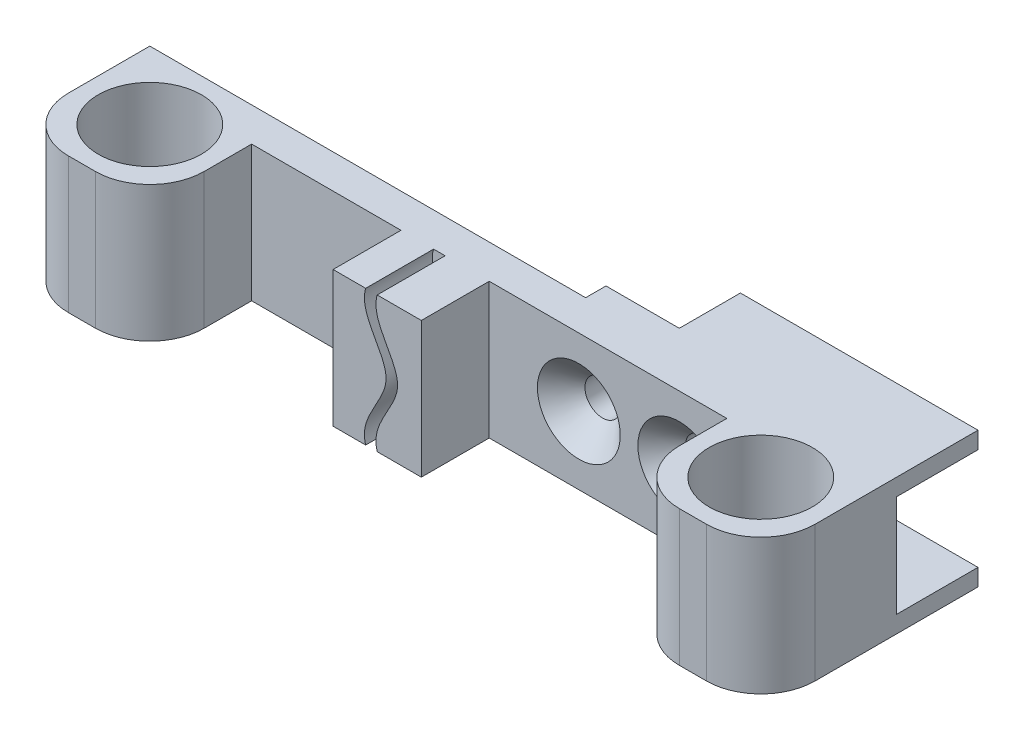
ISO-10303-21;
HEADER;
FILE_DESCRIPTION(('STEP AP214'),'2;1');
FILE_NAME('part.step','',(''),(''),'','','');
FILE_SCHEMA(('AUTOMOTIVE_DESIGN { 1 0 10303 214 1 1 1 1 }'));
ENDSEC;
DATA;
#1=APPLICATION_CONTEXT('core data for automotive mechanical design processes');
#2=APPLICATION_PROTOCOL_DEFINITION('international standard','automotive_design',2000,#1);
#3=PRODUCT_CONTEXT('',#1,'mechanical');
#4=PRODUCT('Part','Part','',(#3));
#5=PRODUCT_RELATED_PRODUCT_CATEGORY('part','',(#4));
#6=PRODUCT_DEFINITION_FORMATION('','',#4);
#7=PRODUCT_DEFINITION_CONTEXT('part definition',#1,'design');
#8=PRODUCT_DEFINITION('design','',#6,#7);
#9=PRODUCT_DEFINITION_SHAPE('','',#8);
#10=(LENGTH_UNIT() NAMED_UNIT(*) SI_UNIT(.MILLI.,.METRE.));
#11=(NAMED_UNIT(*) PLANE_ANGLE_UNIT() SI_UNIT($,.RADIAN.));
#12=(NAMED_UNIT(*) SI_UNIT($,.STERADIAN.) SOLID_ANGLE_UNIT());
#13=UNCERTAINTY_MEASURE_WITH_UNIT(LENGTH_MEASURE(1.E-05),#10,'distance_accuracy_value','');
#14=(GEOMETRIC_REPRESENTATION_CONTEXT(3) GLOBAL_UNCERTAINTY_ASSIGNED_CONTEXT((#13)) GLOBAL_UNIT_ASSIGNED_CONTEXT((#10,
#11,#12)) REPRESENTATION_CONTEXT('',''));
#15=CARTESIAN_POINT('',(0.,0.,0.));
#16=DIRECTION('',(0.,0.,1.));
#17=DIRECTION('',(1.,0.,0.));
#18=AXIS2_PLACEMENT_3D('',#15,#16,#17);
#19=CARTESIAN_POINT('',(-13.,20.,15.));
#20=DIRECTION('',(0.,0.,1.));
#21=DIRECTION('',(0.,-1.,0.));
#22=AXIS2_PLACEMENT_3D('',#19,#20,#21);
#23=PLANE('',#22);
#24=CARTESIAN_POINT('',(-6.49999999999999,0.,15.));
#25=CARTESIAN_POINT('',(-7.60220507793465,3.63375222529954,15.));
#26=CARTESIAN_POINT('',(0.602205077934648,10.,15.));
#27=CARTESIAN_POINT('',(-7.60220507793465,16.3662477747005,15.));
#28=CARTESIAN_POINT('',(-6.49999999999999,20.,15.));
#29=B_SPLINE_CURVE_WITH_KNOTS('',3,(#24,#25,#26,#27,#28),.UNSPECIFIED.,.F.,.F.,(4,1,4),(0.,0.5,
1.),.UNSPECIFIED.);
#30=CARTESIAN_POINT('',(-6.5,0.,15.));
#31=VERTEX_POINT('',#30);
#32=CARTESIAN_POINT('',(-6.5,20.,15.));
#33=VERTEX_POINT('',#32);
#34=EDGE_CURVE('E294',#31,#33,#29,.T.);
#35=ORIENTED_EDGE('',*,*,#34,.F.);
#36=DIRECTION('',(1.,0.,0.));
#37=VECTOR('',#36,1.);
#38=CARTESIAN_POINT('',(-13.,0.,15.));
#39=LINE('',#38,#37);
#40=CARTESIAN_POINT('',(0.,0.,15.));
#41=VERTEX_POINT('',#40);
#42=EDGE_CURVE('E470',#31,#41,#39,.T.);
#43=ORIENTED_EDGE('',*,*,#42,.T.);
#44=DIRECTION('',(0.,-1.,0.));
#45=VECTOR('',#44,1.);
#46=CARTESIAN_POINT('',(0.,20.,15.));
#47=LINE('',#46,#45);
#48=CARTESIAN_POINT('',(0.,20.,15.));
#49=VERTEX_POINT('',#48);
#50=EDGE_CURVE('E762',#49,#41,#47,.T.);
#51=ORIENTED_EDGE('',*,*,#50,.F.);
#52=DIRECTION('',(1.,0.,0.));
#53=VECTOR('',#52,1.);
#54=CARTESIAN_POINT('',(-13.,20.,15.));
#55=LINE('',#54,#53);
#56=EDGE_CURVE('E472',#33,#49,#55,.T.);
#57=ORIENTED_EDGE('',*,*,#56,.F.);
#58=EDGE_LOOP('',(#35,#43,#51,#57));
#59=FACE_BOUND('',#58,.T.);
#60=ADVANCED_FACE('F43',(#59),#23,.T.);
#61=CARTESIAN_POINT('',(35.,20.,5.));
#62=DIRECTION('',(0.,0.,-1.));
#63=DIRECTION('',(-1.,0.,0.));
#64=AXIS2_PLACEMENT_3D('',#61,#62,#63);
#65=PLANE('',#64);
#66=CARTESIAN_POINT('',(13.2,10.,5.));
#67=DIRECTION('',(0.,0.,-1.));
#68=DIRECTION('',(-1.,0.,0.));
#69=AXIS2_PLACEMENT_3D('',#66,#67,#68);
#70=CIRCLE('',#69,6.10000000000006);
#71=CARTESIAN_POINT('',(7.09999999999994,10.,5.));
#72=VERTEX_POINT('',#71);
#73=EDGE_CURVE('E744',#72,#72,#70,.T.);
#74=ORIENTED_EDGE('',*,*,#73,.T.);
#75=EDGE_LOOP('',(#74));
#76=FACE_BOUND('',#75,.T.);
#77=CARTESIAN_POINT('',(28.,10.,5.));
#78=DIRECTION('',(0.,0.,-1.));
#79=DIRECTION('',(-1.,0.,0.));
#80=AXIS2_PLACEMENT_3D('',#77,#78,#79);
#81=CIRCLE('',#80,6.10000000000006);
#82=CARTESIAN_POINT('',(21.8999999999999,10.,5.));
#83=VERTEX_POINT('',#82);
#84=EDGE_CURVE('E52',#83,#83,#81,.T.);
#85=ORIENTED_EDGE('',*,*,#84,.T.);
#86=EDGE_LOOP('',(#85));
#87=FACE_BOUND('',#86,.T.);
#88=DIRECTION('',(0.,1.,0.));
#89=VECTOR('',#88,1.);
#90=CARTESIAN_POINT('',(0.,20.,5.));
#91=LINE('',#90,#89);
#92=CARTESIAN_POINT('',(0.,0.,5.));
#93=VERTEX_POINT('',#92);
#94=CARTESIAN_POINT('',(0.,20.,5.));
#95=VERTEX_POINT('',#94);
#96=EDGE_CURVE('E753',#93,#95,#91,.T.);
#97=ORIENTED_EDGE('',*,*,#96,.F.);
#98=DIRECTION('',(1.,0.,0.));
#99=VECTOR('',#98,1.);
#100=CARTESIAN_POINT('',(35.,0.,5.));
#101=LINE('',#100,#99);
#102=CARTESIAN_POINT('',(35.,0.,5.));
#103=VERTEX_POINT('',#102);
#104=EDGE_CURVE('E676',#93,#103,#101,.T.);
#105=ORIENTED_EDGE('',*,*,#104,.T.);
#106=DIRECTION('',(0.,-1.,0.));
#107=VECTOR('',#106,1.);
#108=CARTESIAN_POINT('',(35.,20.,5.));
#109=LINE('',#108,#107);
#110=CARTESIAN_POINT('',(35.,20.,5.));
#111=VERTEX_POINT('',#110);
#112=EDGE_CURVE('E704',#111,#103,#109,.T.);
#113=ORIENTED_EDGE('',*,*,#112,.F.);
#114=DIRECTION('',(1.,0.,0.));
#115=VECTOR('',#114,1.);
#116=CARTESIAN_POINT('',(35.,20.,5.));
#117=LINE('',#116,#115);
#118=EDGE_CURVE('E640',#95,#111,#117,.T.);
#119=ORIENTED_EDGE('',*,*,#118,.F.);
#120=EDGE_LOOP('',(#97,#105,#113,#119));
#121=FACE_BOUND('',#120,.T.);
#122=ADVANCED_FACE('F429',(#76,#87,#121),#65,.F.);
#123=CARTESIAN_POINT('',(-55.,20.,0.));
#124=DIRECTION('',(0.,0.,1.));
#125=DIRECTION('',(1.,0.,0.));
#126=AXIS2_PLACEMENT_3D('',#123,#124,#125);
#127=PLANE('',#126);
#128=DIRECTION('',(1.,0.,0.));
#129=VECTOR('',#128,1.);
#130=CARTESIAN_POINT('',(55.,2.5,0.));
#131=LINE('',#130,#129);
#132=CARTESIAN_POINT('',(32.,2.5,0.));
#133=VERTEX_POINT('',#132);
#134=CARTESIAN_POINT('',(55.,2.5,0.));
#135=VERTEX_POINT('',#134);
#136=EDGE_CURVE('E497',#133,#135,#131,.T.);
#137=ORIENTED_EDGE('',*,*,#136,.F.);
#138=DIRECTION('',(0.,-1.,0.));
#139=VECTOR('',#138,1.);
#140=CARTESIAN_POINT('',(32.,0.,0.));
#141=LINE('',#140,#139);
#142=CARTESIAN_POINT('',(32.,17.5,0.));
#143=VERTEX_POINT('',#142);
#144=EDGE_CURVE('E577',#143,#133,#141,.T.);
#145=ORIENTED_EDGE('',*,*,#144,.F.);
#146=DIRECTION('',(-1.,0.,0.));
#147=VECTOR('',#146,1.);
#148=CARTESIAN_POINT('',(55.,17.5,0.));
#149=LINE('',#148,#147);
#150=CARTESIAN_POINT('',(55.,17.5,0.));
#151=VERTEX_POINT('',#150);
#152=EDGE_CURVE('E537',#151,#143,#149,.T.);
#153=ORIENTED_EDGE('',*,*,#152,.F.);
#154=DIRECTION('',(0.,-1.,0.));
#155=VECTOR('',#154,1.);
#156=CARTESIAN_POINT('',(55.,20.,0.));
#157=LINE('',#156,#155);
#158=EDGE_CURVE('E732',#151,#135,#157,.T.);
#159=ORIENTED_EDGE('',*,*,#158,.T.);
#160=EDGE_LOOP('',(#137,#145,#153,#159));
#161=FACE_BOUND('',#160,.T.);
#162=ADVANCED_FACE('F389',(#161),#127,.F.);
#163=CARTESIAN_POINT('',(32.,0.,-3.));
#164=DIRECTION('',(-1.,0.,0.));
#165=DIRECTION('',(0.,0.,1.));
#166=AXIS2_PLACEMENT_3D('',#163,#164,#165);
#167=PLANE('',#166);
#168=DIRECTION('',(0.,0.,1.));
#169=VECTOR('',#168,1.);
#170=CARTESIAN_POINT('',(32.,2.5,-3.));
#171=LINE('',#170,#169);
#172=CARTESIAN_POINT('',(32.,2.5,-3.));
#173=VERTEX_POINT('',#172);
#174=EDGE_CURVE('E530',#173,#133,#171,.T.);
#175=ORIENTED_EDGE('',*,*,#174,.F.);
#176=DIRECTION('',(0.,-1.,0.));
#177=VECTOR('',#176,1.);
#178=CARTESIAN_POINT('',(32.,0.,-3.));
#179=LINE('',#178,#177);
#180=CARTESIAN_POINT('',(32.,17.5,-3.));
#181=VERTEX_POINT('',#180);
#182=EDGE_CURVE('E580',#181,#173,#179,.T.);
#183=ORIENTED_EDGE('',*,*,#182,.F.);
#184=DIRECTION('',(0.,0.,-1.));
#185=VECTOR('',#184,1.);
#186=CARTESIAN_POINT('',(32.,17.5,-3.));
#187=LINE('',#186,#185);
#188=EDGE_CURVE('E567',#143,#181,#187,.T.);
#189=ORIENTED_EDGE('',*,*,#188,.F.);
#190=ORIENTED_EDGE('',*,*,#144,.T.);
#191=EDGE_LOOP('',(#175,#183,#189,#190));
#192=FACE_BOUND('',#191,.T.);
#193=ADVANCED_FACE('F385',(#192),#167,.F.);
#194=CARTESIAN_POINT('',(0.,0.,-3.));
#195=DIRECTION('',(0.,0.,-1.));
#196=DIRECTION('',(-1.,0.,0.));
#197=AXIS2_PLACEMENT_3D('',#194,#195,#196);
#198=PLANE('',#197);
#199=CARTESIAN_POINT('',(13.2,10.,-3.));
#200=DIRECTION('',(0.,0.,-1.));
#201=DIRECTION('',(-1.,0.,0.));
#202=AXIS2_PLACEMENT_3D('',#199,#200,#201);
#203=CIRCLE('',#202,2.6);
#204=CARTESIAN_POINT('',(10.6,10.,-3.));
#205=VERTEX_POINT('',#204);
#206=EDGE_CURVE('E493',#205,#205,#203,.T.);
#207=ORIENTED_EDGE('',*,*,#206,.F.);
#208=EDGE_LOOP('',(#207));
#209=FACE_BOUND('',#208,.T.);
#210=CARTESIAN_POINT('',(28.,10.,-3.));
#211=DIRECTION('',(0.,0.,-1.));
#212=DIRECTION('',(-1.,0.,0.));
#213=AXIS2_PLACEMENT_3D('',#210,#211,#212);
#214=CIRCLE('',#213,2.6);
#215=CARTESIAN_POINT('',(25.4,10.,-3.));
#216=VERTEX_POINT('',#215);
#217=EDGE_CURVE('E488',#216,#216,#214,.T.);
#218=ORIENTED_EDGE('',*,*,#217,.F.);
#219=EDGE_LOOP('',(#218));
#220=FACE_BOUND('',#219,.T.);
#221=DIRECTION('',(-1.,0.,0.));
#222=VECTOR('',#221,1.);
#223=CARTESIAN_POINT('',(0.,2.5,-3.));
#224=LINE('',#223,#222);
#225=CARTESIAN_POINT('',(20.,2.5,-3.));
#226=VERTEX_POINT('',#225);
#227=EDGE_CURVE('E527',#173,#226,#224,.T.);
#228=ORIENTED_EDGE('',*,*,#227,.T.);
#229=DIRECTION('',(0.,-1.,0.));
#230=VECTOR('',#229,1.);
#231=CARTESIAN_POINT('',(20.,0.,-3.));
#232=LINE('',#231,#230);
#233=CARTESIAN_POINT('',(20.,0.,-3.));
#234=VERTEX_POINT('',#233);
#235=EDGE_CURVE('E534',#226,#234,#232,.T.);
#236=ORIENTED_EDGE('',*,*,#235,.T.);
#237=DIRECTION('',(-1.,0.,0.));
#238=VECTOR('',#237,1.);
#239=CARTESIAN_POINT('',(9.2,0.,-3.));
#240=LINE('',#239,#238);
#241=CARTESIAN_POINT('',(9.2,0.,-3.));
#242=VERTEX_POINT('',#241);
#243=EDGE_CURVE('E584',#234,#242,#240,.T.);
#244=ORIENTED_EDGE('',*,*,#243,.T.);
#245=DIRECTION('',(0.,1.,0.));
#246=VECTOR('',#245,1.);
#247=CARTESIAN_POINT('',(9.2,0.,-3.));
#248=LINE('',#247,#246);
#249=CARTESIAN_POINT('',(9.2,20.,-3.));
#250=VERTEX_POINT('',#249);
#251=EDGE_CURVE('E572',#242,#250,#248,.T.);
#252=ORIENTED_EDGE('',*,*,#251,.T.);
#253=DIRECTION('',(1.,0.,0.));
#254=VECTOR('',#253,1.);
#255=CARTESIAN_POINT('',(9.2,20.,-3.));
#256=LINE('',#255,#254);
#257=CARTESIAN_POINT('',(20.,20.,-3.));
#258=VERTEX_POINT('',#257);
#259=EDGE_CURVE('E576',#250,#258,#256,.T.);
#260=ORIENTED_EDGE('',*,*,#259,.T.);
#261=DIRECTION('',(0.,-1.,0.));
#262=VECTOR('',#261,1.);
#263=CARTESIAN_POINT('',(20.,0.,-3.));
#264=LINE('',#263,#262);
#265=CARTESIAN_POINT('',(20.,17.5,-3.));
#266=VERTEX_POINT('',#265);
#267=EDGE_CURVE('E734',#258,#266,#264,.T.);
#268=ORIENTED_EDGE('',*,*,#267,.T.);
#269=DIRECTION('',(1.,0.,0.));
#270=VECTOR('',#269,1.);
#271=CARTESIAN_POINT('',(0.,17.5,-3.));
#272=LINE('',#271,#270);
#273=EDGE_CURVE('E737',#266,#181,#272,.T.);
#274=ORIENTED_EDGE('',*,*,#273,.T.);
#275=ORIENTED_EDGE('',*,*,#182,.T.);
#276=EDGE_LOOP('',(#228,#236,#244,#252,#260,#268,#274,#275));
#277=FACE_BOUND('',#276,.T.);
#278=ADVANCED_FACE('F381',(#209,#220,#277),#198,.T.);
#279=DIRECTION('',(0.,1.,0.));
#280=VECTOR('',#279,1.);
#281=CARTESIAN_POINT('',(9.2,0.,0.));
#282=LINE('',#281,#280);
#283=CARTESIAN_POINT('',(9.20000000000001,0.,0.));
#284=VERTEX_POINT('',#283);
#285=CARTESIAN_POINT('',(9.20000000000001,20.,0.));
#286=VERTEX_POINT('',#285);
#287=EDGE_CURVE('E571',#284,#286,#282,.T.);
#288=ORIENTED_EDGE('',*,*,#287,.F.);
#289=DIRECTION('',(-1.,0.,0.));
#290=VECTOR('',#289,1.);
#291=CARTESIAN_POINT('',(-55.,0.,0.));
#292=LINE('',#291,#290);
#293=CARTESIAN_POINT('',(-55.,0.,0.));
#294=VERTEX_POINT('',#293);
#295=EDGE_CURVE('E658',#284,#294,#292,.T.);
#296=ORIENTED_EDGE('',*,*,#295,.T.);
#297=DIRECTION('',(0.,-1.,0.));
#298=VECTOR('',#297,1.);
#299=CARTESIAN_POINT('',(-55.,20.,0.));
#300=LINE('',#299,#298);
#301=CARTESIAN_POINT('',(-55.,20.,0.));
#302=VERTEX_POINT('',#301);
#303=EDGE_CURVE('E728',#302,#294,#300,.T.);
#304=ORIENTED_EDGE('',*,*,#303,.F.);
#305=DIRECTION('',(-1.,0.,0.));
#306=VECTOR('',#305,1.);
#307=CARTESIAN_POINT('',(-55.,20.,0.));
#308=LINE('',#307,#306);
#309=EDGE_CURVE('E621',#286,#302,#308,.T.);
#310=ORIENTED_EDGE('',*,*,#309,.F.);
#311=EDGE_LOOP('',(#288,#296,#304,#310));
#312=FACE_BOUND('',#311,.T.);
#313=ADVANCED_FACE('F384',(#312),#127,.F.);
#314=CARTESIAN_POINT('',(47.,20.,12.));
#315=DIRECTION('',(0.,1.,0.));
#316=DIRECTION('',(0.,0.,1.));
#317=AXIS2_PLACEMENT_3D('',#314,#315,#316);
#318=PLANE('',#317);
#319=DIRECTION('',(0.,0.,1.));
#320=VECTOR('',#319,1.);
#321=CARTESIAN_POINT('',(-6.5,20.,5.));
#322=LINE('',#321,#320);
#323=CARTESIAN_POINT('',(-6.5,20.,5.));
#324=VERTEX_POINT('',#323);
#325=EDGE_CURVE('E288',#324,#33,#322,.T.);
#326=ORIENTED_EDGE('',*,*,#325,.T.);
#327=ORIENTED_EDGE('',*,*,#56,.T.);
#328=DIRECTION('',(0.,0.,1.));
#329=VECTOR('',#328,1.);
#330=CARTESIAN_POINT('',(0.,20.,5.));
#331=LINE('',#330,#329);
#332=EDGE_CURVE('E758',#95,#49,#331,.T.);
#333=ORIENTED_EDGE('',*,*,#332,.F.);
#334=ORIENTED_EDGE('',*,*,#118,.T.);
#335=DIRECTION('',(0.,0.,1.));
#336=VECTOR('',#335,1.);
#337=CARTESIAN_POINT('',(35.,20.,12.));
#338=LINE('',#337,#336);
#339=CARTESIAN_POINT('',(35.,20.,12.));
#340=VERTEX_POINT('',#339);
#341=EDGE_CURVE('E644',#111,#340,#338,.T.);
#342=ORIENTED_EDGE('',*,*,#341,.T.);
#343=CARTESIAN_POINT('',(43.,20.,12.));
#344=DIRECTION('',(0.,1.,0.));
#345=DIRECTION('',(0.,0.,-1.));
#346=AXIS2_PLACEMENT_3D('',#343,#344,#345);
#347=CIRCLE('',#346,8.);
#348=CARTESIAN_POINT('',(43.,20.,20.));
#349=VERTEX_POINT('',#348);
#350=EDGE_CURVE('E647',#340,#349,#347,.T.);
#351=ORIENTED_EDGE('',*,*,#350,.T.);
#352=DIRECTION('',(1.,0.,0.));
#353=VECTOR('',#352,1.);
#354=CARTESIAN_POINT('',(47.,20.,20.));
#355=LINE('',#354,#353);
#356=CARTESIAN_POINT('',(47.,20.,20.));
#357=VERTEX_POINT('',#356);
#358=EDGE_CURVE('E650',#349,#357,#355,.T.);
#359=ORIENTED_EDGE('',*,*,#358,.T.);
#360=CARTESIAN_POINT('',(47.,20.,12.));
#361=DIRECTION('',(0.,1.,0.));
#362=DIRECTION('',(0.,0.,1.));
#363=AXIS2_PLACEMENT_3D('',#360,#361,#362);
#364=CIRCLE('',#363,8.);
#365=CARTESIAN_POINT('',(55.,20.,12.));
#366=VERTEX_POINT('',#365);
#367=EDGE_CURVE('E653',#357,#366,#364,.T.);
#368=ORIENTED_EDGE('',*,*,#367,.T.);
#369=DIRECTION('',(0.,0.,-1.));
#370=VECTOR('',#369,1.);
#371=CARTESIAN_POINT('',(55.,20.,0.));
#372=LINE('',#371,#370);
#373=CARTESIAN_POINT('',(55.,20.,-12.));
#374=VERTEX_POINT('',#373);
#375=EDGE_CURVE('E618',#366,#374,#372,.T.);
#376=ORIENTED_EDGE('',*,*,#375,.T.);
#377=DIRECTION('',(1.,0.,0.));
#378=VECTOR('',#377,1.);
#379=CARTESIAN_POINT('',(55.,20.,-12.));
#380=LINE('',#379,#378);
#381=CARTESIAN_POINT('',(20.,20.,-12.));
#382=VERTEX_POINT('',#381);
#383=EDGE_CURVE('E548',#382,#374,#380,.T.);
#384=ORIENTED_EDGE('',*,*,#383,.F.);
#385=DIRECTION('',(0.,0.,1.));
#386=VECTOR('',#385,1.);
#387=CARTESIAN_POINT('',(20.,20.,-12.));
#388=LINE('',#387,#386);
#389=EDGE_CURVE('E552',#382,#258,#388,.T.);
#390=ORIENTED_EDGE('',*,*,#389,.T.);
#391=ORIENTED_EDGE('',*,*,#259,.F.);
#392=DIRECTION('',(0.,0.,1.));
#393=VECTOR('',#392,1.);
#394=CARTESIAN_POINT('',(9.2,20.,-3.));
#395=LINE('',#394,#393);
#396=EDGE_CURVE('E597',#250,#286,#395,.T.);
#397=ORIENTED_EDGE('',*,*,#396,.T.);
#398=ORIENTED_EDGE('',*,*,#309,.T.);
#399=DIRECTION('',(0.,0.,1.));
#400=VECTOR('',#399,1.);
#401=CARTESIAN_POINT('',(-55.,20.,0.));
#402=LINE('',#401,#400);
#403=CARTESIAN_POINT('',(-55.,20.,12.));
#404=VERTEX_POINT('',#403);
#405=EDGE_CURVE('E625',#302,#404,#402,.T.);
#406=ORIENTED_EDGE('',*,*,#405,.T.);
#407=CARTESIAN_POINT('',(-47.,20.,12.));
#408=DIRECTION('',(0.,1.,0.));
#409=DIRECTION('',(0.,0.,1.));
#410=AXIS2_PLACEMENT_3D('',#407,#408,#409);
#411=CIRCLE('',#410,8.);
#412=CARTESIAN_POINT('',(-47.,20.,20.));
#413=VERTEX_POINT('',#412);
#414=EDGE_CURVE('E628',#404,#413,#411,.T.);
#415=ORIENTED_EDGE('',*,*,#414,.T.);
#416=DIRECTION('',(1.,0.,0.));
#417=VECTOR('',#416,1.);
#418=CARTESIAN_POINT('',(-47.,20.,20.));
#419=LINE('',#418,#417);
#420=CARTESIAN_POINT('',(-43.,20.,20.));
#421=VERTEX_POINT('',#420);
#422=EDGE_CURVE('E631',#413,#421,#419,.T.);
#423=ORIENTED_EDGE('',*,*,#422,.T.);
#424=CARTESIAN_POINT('',(-43.,20.,12.));
#425=DIRECTION('',(0.,1.,0.));
#426=DIRECTION('',(0.,0.,-1.));
#427=AXIS2_PLACEMENT_3D('',#424,#425,#426);
#428=CIRCLE('',#427,8.);
#429=CARTESIAN_POINT('',(-35.,20.,12.));
#430=VERTEX_POINT('',#429);
#431=EDGE_CURVE('E634',#421,#430,#428,.T.);
#432=ORIENTED_EDGE('',*,*,#431,.T.);
#433=DIRECTION('',(0.,0.,-1.));
#434=VECTOR('',#433,1.);
#435=CARTESIAN_POINT('',(-35.,20.,12.));
#436=LINE('',#435,#434);
#437=CARTESIAN_POINT('',(-35.,20.,5.));
#438=VERTEX_POINT('',#437);
#439=EDGE_CURVE('E637',#430,#438,#436,.T.);
#440=ORIENTED_EDGE('',*,*,#439,.T.);
#441=CARTESIAN_POINT('',(-13.,20.,5.));
#442=VERTEX_POINT('',#441);
#443=EDGE_CURVE('E641',#438,#442,#117,.T.);
#444=ORIENTED_EDGE('',*,*,#443,.T.);
#445=DIRECTION('',(0.,0.,1.));
#446=VECTOR('',#445,1.);
#447=CARTESIAN_POINT('',(-13.,20.,5.));
#448=LINE('',#447,#446);
#449=CARTESIAN_POINT('',(-13.,20.,15.));
#450=VERTEX_POINT('',#449);
#451=EDGE_CURVE('E764',#442,#450,#448,.T.);
#452=ORIENTED_EDGE('',*,*,#451,.T.);
#453=CARTESIAN_POINT('',(-8.2,20.,15.));
#454=VERTEX_POINT('',#453);
#455=EDGE_CURVE('E482',#450,#454,#55,.T.);
#456=ORIENTED_EDGE('',*,*,#455,.T.);
#457=DIRECTION('',(0.,0.,1.));
#458=VECTOR('',#457,1.);
#459=CARTESIAN_POINT('',(-8.19999999999999,20.,5.));
#460=LINE('',#459,#458);
#461=CARTESIAN_POINT('',(-8.19999999999999,20.,5.));
#462=VERTEX_POINT('',#461);
#463=EDGE_CURVE('E59',#462,#454,#460,.T.);
#464=ORIENTED_EDGE('',*,*,#463,.F.);
#465=DIRECTION('',(-1.,0.,0.));
#466=VECTOR('',#465,1.);
#467=CARTESIAN_POINT('',(-8.19999999999999,20.,5.));
#468=LINE('',#467,#466);
#469=EDGE_CURVE('E304',#324,#462,#468,.T.);
#470=ORIENTED_EDGE('',*,*,#469,.F.);
#471=EDGE_LOOP('',(#326,#327,#333,#334,#342,#351,#359,#368,#376,#384,#390,#391,#397,#398,#406,
#415,#423,#432,#440,#444,#452,#456,#464,#470));
#472=FACE_BOUND('',#471,.T.);
#473=CARTESIAN_POINT('',(45.,20.,10.));
#474=DIRECTION('',(0.,1.,0.));
#475=DIRECTION('',(0.,0.,1.));
#476=AXIS2_PLACEMENT_3D('',#473,#474,#475);
#477=CIRCLE('',#476,7.6);
#478=CARTESIAN_POINT('',(45.,20.,17.6));
#479=VERTEX_POINT('',#478);
#480=EDGE_CURVE('E610',#479,#479,#477,.T.);
#481=ORIENTED_EDGE('',*,*,#480,.F.);
#482=EDGE_LOOP('',(#481));
#483=FACE_BOUND('',#482,.T.);
#484=CARTESIAN_POINT('',(-45.,20.,10.));
#485=DIRECTION('',(0.,1.,0.));
#486=DIRECTION('',(0.,0.,-1.));
#487=AXIS2_PLACEMENT_3D('',#484,#485,#486);
#488=CIRCLE('',#487,7.6);
#489=CARTESIAN_POINT('',(-45.,20.,2.40000000000001));
#490=VERTEX_POINT('',#489);
#491=EDGE_CURVE('E602',#490,#490,#488,.T.);
#492=ORIENTED_EDGE('',*,*,#491,.F.);
#493=EDGE_LOOP('',(#492));
#494=FACE_BOUND('',#493,.T.);
#495=ADVANCED_FACE('F310',(#472,#483,#494),#318,.T.);
#496=CARTESIAN_POINT('',(47.,0.,12.));
#497=DIRECTION('',(0.,1.,0.));
#498=DIRECTION('',(0.,0.,1.));
#499=AXIS2_PLACEMENT_3D('',#496,#497,#498);
#500=PLANE('',#499);
#501=ORIENTED_EDGE('',*,*,#42,.F.);
#502=DIRECTION('',(0.,0.,1.));
#503=VECTOR('',#502,1.);
#504=CARTESIAN_POINT('',(-6.5,0.,5.));
#505=LINE('',#504,#503);
#506=CARTESIAN_POINT('',(-6.5,0.,5.));
#507=VERTEX_POINT('',#506);
#508=EDGE_CURVE('E476',#507,#31,#505,.T.);
#509=ORIENTED_EDGE('',*,*,#508,.F.);
#510=DIRECTION('',(1.,0.,0.));
#511=VECTOR('',#510,1.);
#512=CARTESIAN_POINT('',(-6.5,0.,5.));
#513=LINE('',#512,#511);
#514=CARTESIAN_POINT('',(-8.19999999999999,0.,5.));
#515=VERTEX_POINT('',#514);
#516=EDGE_CURVE('E298',#515,#507,#513,.T.);
#517=ORIENTED_EDGE('',*,*,#516,.F.);
#518=DIRECTION('',(0.,0.,1.));
#519=VECTOR('',#518,1.);
#520=CARTESIAN_POINT('',(-8.19999999999999,0.,5.));
#521=LINE('',#520,#519);
#522=CARTESIAN_POINT('',(-8.19999999999999,0.,15.));
#523=VERTEX_POINT('',#522);
#524=EDGE_CURVE('E780',#515,#523,#521,.T.);
#525=ORIENTED_EDGE('',*,*,#524,.T.);
#526=CARTESIAN_POINT('',(-13.,0.,15.));
#527=VERTEX_POINT('',#526);
#528=EDGE_CURVE('E481',#527,#523,#39,.T.);
#529=ORIENTED_EDGE('',*,*,#528,.F.);
#530=DIRECTION('',(0.,0.,-1.));
#531=VECTOR('',#530,1.);
#532=CARTESIAN_POINT('',(-13.,0.,5.));
#533=LINE('',#532,#531);
#534=CARTESIAN_POINT('',(-13.,0.,5.));
#535=VERTEX_POINT('',#534);
#536=EDGE_CURVE('E769',#527,#535,#533,.T.);
#537=ORIENTED_EDGE('',*,*,#536,.T.);
#538=CARTESIAN_POINT('',(-35.,0.,5.));
#539=VERTEX_POINT('',#538);
#540=EDGE_CURVE('E677',#539,#535,#101,.T.);
#541=ORIENTED_EDGE('',*,*,#540,.F.);
#542=DIRECTION('',(0.,0.,-1.));
#543=VECTOR('',#542,1.);
#544=CARTESIAN_POINT('',(-35.,0.,12.));
#545=LINE('',#544,#543);
#546=CARTESIAN_POINT('',(-35.,0.,12.));
#547=VERTEX_POINT('',#546);
#548=EDGE_CURVE('E673',#547,#539,#545,.T.);
#549=ORIENTED_EDGE('',*,*,#548,.F.);
#550=CARTESIAN_POINT('',(-43.,0.,12.));
#551=DIRECTION('',(0.,1.,0.));
#552=DIRECTION('',(0.,0.,-1.));
#553=AXIS2_PLACEMENT_3D('',#550,#551,#552);
#554=CIRCLE('',#553,8.);
#555=CARTESIAN_POINT('',(-43.,0.,20.));
#556=VERTEX_POINT('',#555);
#557=EDGE_CURVE('E670',#556,#547,#554,.T.);
#558=ORIENTED_EDGE('',*,*,#557,.F.);
#559=DIRECTION('',(1.,0.,0.));
#560=VECTOR('',#559,1.);
#561=CARTESIAN_POINT('',(-47.,0.,20.));
#562=LINE('',#561,#560);
#563=CARTESIAN_POINT('',(-47.,0.,20.));
#564=VERTEX_POINT('',#563);
#565=EDGE_CURVE('E667',#564,#556,#562,.T.);
#566=ORIENTED_EDGE('',*,*,#565,.F.);
#567=CARTESIAN_POINT('',(-47.,0.,12.));
#568=DIRECTION('',(0.,1.,0.));
#569=DIRECTION('',(0.,0.,1.));
#570=AXIS2_PLACEMENT_3D('',#567,#568,#569);
#571=CIRCLE('',#570,8.);
#572=CARTESIAN_POINT('',(-55.,0.,12.));
#573=VERTEX_POINT('',#572);
#574=EDGE_CURVE('E664',#573,#564,#571,.T.);
#575=ORIENTED_EDGE('',*,*,#574,.F.);
#576=DIRECTION('',(0.,0.,1.));
#577=VECTOR('',#576,1.);
#578=CARTESIAN_POINT('',(-55.,0.,0.));
#579=LINE('',#578,#577);
#580=EDGE_CURVE('E661',#294,#573,#579,.T.);
#581=ORIENTED_EDGE('',*,*,#580,.F.);
#582=ORIENTED_EDGE('',*,*,#295,.F.);
#583=DIRECTION('',(0.,0.,1.));
#584=VECTOR('',#583,1.);
#585=CARTESIAN_POINT('',(9.2,0.,-3.));
#586=LINE('',#585,#584);
#587=EDGE_CURVE('E587',#242,#284,#586,.T.);
#588=ORIENTED_EDGE('',*,*,#587,.F.);
#589=ORIENTED_EDGE('',*,*,#243,.F.);
#590=DIRECTION('',(0.,0.,1.));
#591=VECTOR('',#590,1.);
#592=CARTESIAN_POINT('',(20.,0.,-12.));
#593=LINE('',#592,#591);
#594=CARTESIAN_POINT('',(20.,0.,-12.));
#595=VERTEX_POINT('',#594);
#596=EDGE_CURVE('E523',#595,#234,#593,.T.);
#597=ORIENTED_EDGE('',*,*,#596,.F.);
#598=DIRECTION('',(-1.,0.,0.));
#599=VECTOR('',#598,1.);
#600=CARTESIAN_POINT('',(55.,0.,-12.));
#601=LINE('',#600,#599);
#602=CARTESIAN_POINT('',(55.,0.,-12.));
#603=VERTEX_POINT('',#602);
#604=EDGE_CURVE('E504',#603,#595,#601,.T.);
#605=ORIENTED_EDGE('',*,*,#604,.F.);
#606=DIRECTION('',(0.,0.,-1.));
#607=VECTOR('',#606,1.);
#608=CARTESIAN_POINT('',(55.,0.,0.));
#609=LINE('',#608,#607);
#610=CARTESIAN_POINT('',(55.,0.,12.));
#611=VERTEX_POINT('',#610);
#612=EDGE_CURVE('E614',#611,#603,#609,.T.);
#613=ORIENTED_EDGE('',*,*,#612,.F.);
#614=CARTESIAN_POINT('',(47.,0.,12.));
#615=DIRECTION('',(0.,1.,0.));
#616=DIRECTION('',(0.,0.,1.));
#617=AXIS2_PLACEMENT_3D('',#614,#615,#616);
#618=CIRCLE('',#617,8.);
#619=CARTESIAN_POINT('',(47.,0.,20.));
#620=VERTEX_POINT('',#619);
#621=EDGE_CURVE('E622',#620,#611,#618,.T.);
#622=ORIENTED_EDGE('',*,*,#621,.F.);
#623=DIRECTION('',(1.,0.,0.));
#624=VECTOR('',#623,1.);
#625=CARTESIAN_POINT('',(47.,0.,20.));
#626=LINE('',#625,#624);
#627=CARTESIAN_POINT('',(43.,0.,20.));
#628=VERTEX_POINT('',#627);
#629=EDGE_CURVE('E686',#628,#620,#626,.T.);
#630=ORIENTED_EDGE('',*,*,#629,.F.);
#631=CARTESIAN_POINT('',(43.,0.,12.));
#632=DIRECTION('',(0.,1.,0.));
#633=DIRECTION('',(0.,0.,-1.));
#634=AXIS2_PLACEMENT_3D('',#631,#632,#633);
#635=CIRCLE('',#634,8.);
#636=CARTESIAN_POINT('',(35.,0.,12.));
#637=VERTEX_POINT('',#636);
#638=EDGE_CURVE('E683',#637,#628,#635,.T.);
#639=ORIENTED_EDGE('',*,*,#638,.F.);
#640=DIRECTION('',(0.,0.,1.));
#641=VECTOR('',#640,1.);
#642=CARTESIAN_POINT('',(35.,0.,12.));
#643=LINE('',#642,#641);
#644=EDGE_CURVE('E680',#103,#637,#643,.T.);
#645=ORIENTED_EDGE('',*,*,#644,.F.);
#646=ORIENTED_EDGE('',*,*,#104,.F.);
#647=DIRECTION('',(0.,0.,-1.));
#648=VECTOR('',#647,1.);
#649=CARTESIAN_POINT('',(0.,0.,5.));
#650=LINE('',#649,#648);
#651=EDGE_CURVE('E479',#41,#93,#650,.T.);
#652=ORIENTED_EDGE('',*,*,#651,.F.);
#653=EDGE_LOOP('',(#501,#509,#517,#525,#529,#537,#541,#549,#558,#566,#575,#581,#582,#588,#589,
#597,#605,#613,#622,#630,#639,#645,#646,#652));
#654=FACE_BOUND('',#653,.T.);
#655=CARTESIAN_POINT('',(-45.,0.,10.));
#656=DIRECTION('',(0.,1.,0.));
#657=DIRECTION('',(0.,0.,-1.));
#658=AXIS2_PLACEMENT_3D('',#655,#656,#657);
#659=CIRCLE('',#658,7.6);
#660=CARTESIAN_POINT('',(-45.,0.,2.40000000000001));
#661=VERTEX_POINT('',#660);
#662=EDGE_CURVE('E601',#661,#661,#659,.T.);
#663=ORIENTED_EDGE('',*,*,#662,.T.);
#664=EDGE_LOOP('',(#663));
#665=FACE_BOUND('',#664,.T.);
#666=CARTESIAN_POINT('',(45.,0.,10.));
#667=DIRECTION('',(0.,1.,0.));
#668=DIRECTION('',(0.,0.,1.));
#669=AXIS2_PLACEMENT_3D('',#666,#667,#668);
#670=CIRCLE('',#669,7.6);
#671=CARTESIAN_POINT('',(45.,0.,17.6));
#672=VERTEX_POINT('',#671);
#673=EDGE_CURVE('E606',#672,#672,#670,.T.);
#674=ORIENTED_EDGE('',*,*,#673,.T.);
#675=EDGE_LOOP('',(#674));
#676=FACE_BOUND('',#675,.T.);
#677=ADVANCED_FACE('F405',(#654,#665,#676),#500,.F.);
#678=CARTESIAN_POINT('',(55.,20.,0.));
#679=DIRECTION('',(-1.,0.,0.));
#680=DIRECTION('',(0.,0.,1.));
#681=AXIS2_PLACEMENT_3D('',#678,#679,#680);
#682=PLANE('',#681);
#683=ORIENTED_EDGE('',*,*,#612,.T.);
#684=DIRECTION('',(0.,-1.,0.));
#685=VECTOR('',#684,1.);
#686=CARTESIAN_POINT('',(55.,0.,-12.));
#687=LINE('',#686,#685);
#688=CARTESIAN_POINT('',(55.,2.5,-12.));
#689=VERTEX_POINT('',#688);
#690=EDGE_CURVE('E501',#689,#603,#687,.T.);
#691=ORIENTED_EDGE('',*,*,#690,.F.);
#692=DIRECTION('',(0.,0.,1.));
#693=VECTOR('',#692,1.);
#694=CARTESIAN_POINT('',(55.,2.5,-12.));
#695=LINE('',#694,#693);
#696=EDGE_CURVE('E513',#689,#135,#695,.T.);
#697=ORIENTED_EDGE('',*,*,#696,.T.);
#698=ORIENTED_EDGE('',*,*,#158,.F.);
#699=DIRECTION('',(0.,0.,1.));
#700=VECTOR('',#699,1.);
#701=CARTESIAN_POINT('',(55.,17.5,-12.));
#702=LINE('',#701,#700);
#703=CARTESIAN_POINT('',(55.,17.5,-12.));
#704=VERTEX_POINT('',#703);
#705=EDGE_CURVE('E563',#704,#151,#702,.T.);
#706=ORIENTED_EDGE('',*,*,#705,.F.);
#707=DIRECTION('',(0.,-1.,0.));
#708=VECTOR('',#707,1.);
#709=CARTESIAN_POINT('',(55.,20.,-12.));
#710=LINE('',#709,#708);
#711=EDGE_CURVE('E538',#374,#704,#710,.T.);
#712=ORIENTED_EDGE('',*,*,#711,.F.);
#713=ORIENTED_EDGE('',*,*,#375,.F.);
#714=DIRECTION('',(0.,-1.,0.));
#715=VECTOR('',#714,1.);
#716=CARTESIAN_POINT('',(55.,20.,12.));
#717=LINE('',#716,#715);
#718=EDGE_CURVE('E656',#366,#611,#717,.T.);
#719=ORIENTED_EDGE('',*,*,#718,.T.);
#720=EDGE_LOOP('',(#683,#691,#697,#698,#706,#712,#713,#719));
#721=FACE_BOUND('',#720,.T.);
#722=ADVANCED_FACE('F408',(#721),#682,.F.);
#723=CARTESIAN_POINT('',(-55.,20.,0.));
#724=DIRECTION('',(1.,0.,0.));
#725=DIRECTION('',(0.,0.,-1.));
#726=AXIS2_PLACEMENT_3D('',#723,#724,#725);
#727=PLANE('',#726);
#728=ORIENTED_EDGE('',*,*,#580,.T.);
#729=DIRECTION('',(0.,-1.,0.));
#730=VECTOR('',#729,1.);
#731=CARTESIAN_POINT('',(-55.,20.,12.));
#732=LINE('',#731,#730);
#733=EDGE_CURVE('E724',#404,#573,#732,.T.);
#734=ORIENTED_EDGE('',*,*,#733,.F.);
#735=ORIENTED_EDGE('',*,*,#405,.F.);
#736=ORIENTED_EDGE('',*,*,#303,.T.);
#737=EDGE_LOOP('',(#728,#734,#735,#736));
#738=FACE_BOUND('',#737,.T.);
#739=ADVANCED_FACE('F444',(#738),#727,.F.);
#740=CARTESIAN_POINT('',(-47.,20.,12.));
#741=DIRECTION('',(0.,-1.,0.));
#742=DIRECTION('',(0.,0.,-1.));
#743=AXIS2_PLACEMENT_3D('',#740,#741,#742);
#744=CYLINDRICAL_SURFACE('',#743,8.);
#745=ORIENTED_EDGE('',*,*,#574,.T.);
#746=DIRECTION('',(0.,-1.,0.));
#747=VECTOR('',#746,1.);
#748=CARTESIAN_POINT('',(-47.,20.,20.));
#749=LINE('',#748,#747);
#750=EDGE_CURVE('E720',#413,#564,#749,.T.);
#751=ORIENTED_EDGE('',*,*,#750,.F.);
#752=ORIENTED_EDGE('',*,*,#414,.F.);
#753=ORIENTED_EDGE('',*,*,#733,.T.);
#754=EDGE_LOOP('',(#745,#751,#752,#753));
#755=FACE_BOUND('',#754,.T.);
#756=ADVANCED_FACE('F440',(#755),#744,.T.);
#757=CARTESIAN_POINT('',(-47.,20.,20.));
#758=DIRECTION('',(0.,0.,-1.));
#759=DIRECTION('',(-1.,0.,0.));
#760=AXIS2_PLACEMENT_3D('',#757,#758,#759);
#761=PLANE('',#760);
#762=ORIENTED_EDGE('',*,*,#565,.T.);
#763=DIRECTION('',(0.,-1.,0.));
#764=VECTOR('',#763,1.);
#765=CARTESIAN_POINT('',(-43.,20.,20.));
#766=LINE('',#765,#764);
#767=EDGE_CURVE('E716',#421,#556,#766,.T.);
#768=ORIENTED_EDGE('',*,*,#767,.F.);
#769=ORIENTED_EDGE('',*,*,#422,.F.);
#770=ORIENTED_EDGE('',*,*,#750,.T.);
#771=EDGE_LOOP('',(#762,#768,#769,#770));
#772=FACE_BOUND('',#771,.T.);
#773=ADVANCED_FACE('F436',(#772),#761,.F.);
#774=CARTESIAN_POINT('',(-43.,20.,12.));
#775=DIRECTION('',(0.,-1.,0.));
#776=DIRECTION('',(0.,0.,-1.));
#777=AXIS2_PLACEMENT_3D('',#774,#775,#776);
#778=CYLINDRICAL_SURFACE('',#777,8.);
#779=ORIENTED_EDGE('',*,*,#557,.T.);
#780=DIRECTION('',(0.,-1.,0.));
#781=VECTOR('',#780,1.);
#782=CARTESIAN_POINT('',(-35.,20.,12.));
#783=LINE('',#782,#781);
#784=EDGE_CURVE('E712',#430,#547,#783,.T.);
#785=ORIENTED_EDGE('',*,*,#784,.F.);
#786=ORIENTED_EDGE('',*,*,#431,.F.);
#787=ORIENTED_EDGE('',*,*,#767,.T.);
#788=EDGE_LOOP('',(#779,#785,#786,#787));
#789=FACE_BOUND('',#788,.T.);
#790=ADVANCED_FACE('F432',(#789),#778,.T.);
#791=CARTESIAN_POINT('',(-35.,20.,12.));
#792=DIRECTION('',(-1.,0.,0.));
#793=DIRECTION('',(0.,0.,1.));
#794=AXIS2_PLACEMENT_3D('',#791,#792,#793);
#795=PLANE('',#794);
#796=ORIENTED_EDGE('',*,*,#548,.T.);
#797=DIRECTION('',(0.,-1.,0.));
#798=VECTOR('',#797,1.);
#799=CARTESIAN_POINT('',(-35.,20.,5.));
#800=LINE('',#799,#798);
#801=EDGE_CURVE('E708',#438,#539,#800,.T.);
#802=ORIENTED_EDGE('',*,*,#801,.F.);
#803=ORIENTED_EDGE('',*,*,#439,.F.);
#804=ORIENTED_EDGE('',*,*,#784,.T.);
#805=EDGE_LOOP('',(#796,#802,#803,#804));
#806=FACE_BOUND('',#805,.T.);
#807=ADVANCED_FACE('F428',(#806),#795,.F.);
#808=ORIENTED_EDGE('',*,*,#540,.T.);
#809=DIRECTION('',(0.,1.,0.));
#810=VECTOR('',#809,1.);
#811=CARTESIAN_POINT('',(-13.,20.,5.));
#812=LINE('',#811,#810);
#813=EDGE_CURVE('E67',#535,#442,#812,.T.);
#814=ORIENTED_EDGE('',*,*,#813,.T.);
#815=ORIENTED_EDGE('',*,*,#443,.F.);
#816=ORIENTED_EDGE('',*,*,#801,.T.);
#817=EDGE_LOOP('',(#808,#814,#815,#816));
#818=FACE_BOUND('',#817,.T.);
#819=ADVANCED_FACE('F424',(#818),#65,.F.);
#820=CARTESIAN_POINT('',(35.,20.,12.));
#821=DIRECTION('',(1.,0.,0.));
#822=DIRECTION('',(0.,0.,-1.));
#823=AXIS2_PLACEMENT_3D('',#820,#821,#822);
#824=PLANE('',#823);
#825=ORIENTED_EDGE('',*,*,#644,.T.);
#826=DIRECTION('',(0.,-1.,0.));
#827=VECTOR('',#826,1.);
#828=CARTESIAN_POINT('',(35.,20.,12.));
#829=LINE('',#828,#827);
#830=EDGE_CURVE('E700',#340,#637,#829,.T.);
#831=ORIENTED_EDGE('',*,*,#830,.F.);
#832=ORIENTED_EDGE('',*,*,#341,.F.);
#833=ORIENTED_EDGE('',*,*,#112,.T.);
#834=EDGE_LOOP('',(#825,#831,#832,#833));
#835=FACE_BOUND('',#834,.T.);
#836=ADVANCED_FACE('F420',(#835),#824,.F.);
#837=CARTESIAN_POINT('',(43.,20.,12.));
#838=DIRECTION('',(0.,-1.,0.));
#839=DIRECTION('',(0.,0.,-1.));
#840=AXIS2_PLACEMENT_3D('',#837,#838,#839);
#841=CYLINDRICAL_SURFACE('',#840,8.);
#842=ORIENTED_EDGE('',*,*,#638,.T.);
#843=DIRECTION('',(0.,-1.,0.));
#844=VECTOR('',#843,1.);
#845=CARTESIAN_POINT('',(43.,20.,20.));
#846=LINE('',#845,#844);
#847=EDGE_CURVE('E696',#349,#628,#846,.T.);
#848=ORIENTED_EDGE('',*,*,#847,.F.);
#849=ORIENTED_EDGE('',*,*,#350,.F.);
#850=ORIENTED_EDGE('',*,*,#830,.T.);
#851=EDGE_LOOP('',(#842,#848,#849,#850));
#852=FACE_BOUND('',#851,.T.);
#853=ADVANCED_FACE('F416',(#852),#841,.T.);
#854=CARTESIAN_POINT('',(47.,20.,20.));
#855=DIRECTION('',(0.,0.,-1.));
#856=DIRECTION('',(-1.,0.,0.));
#857=AXIS2_PLACEMENT_3D('',#854,#855,#856);
#858=PLANE('',#857);
#859=ORIENTED_EDGE('',*,*,#629,.T.);
#860=DIRECTION('',(0.,-1.,0.));
#861=VECTOR('',#860,1.);
#862=CARTESIAN_POINT('',(47.,20.,20.));
#863=LINE('',#862,#861);
#864=EDGE_CURVE('E692',#357,#620,#863,.T.);
#865=ORIENTED_EDGE('',*,*,#864,.F.);
#866=ORIENTED_EDGE('',*,*,#358,.F.);
#867=ORIENTED_EDGE('',*,*,#847,.T.);
#868=EDGE_LOOP('',(#859,#865,#866,#867));
#869=FACE_BOUND('',#868,.T.);
#870=ADVANCED_FACE('F412',(#869),#858,.F.);
#871=CARTESIAN_POINT('',(47.,20.,12.));
#872=DIRECTION('',(0.,-1.,0.));
#873=DIRECTION('',(0.,0.,-1.));
#874=AXIS2_PLACEMENT_3D('',#871,#872,#873);
#875=CYLINDRICAL_SURFACE('',#874,8.);
#876=ORIENTED_EDGE('',*,*,#621,.T.);
#877=ORIENTED_EDGE('',*,*,#718,.F.);
#878=ORIENTED_EDGE('',*,*,#367,.F.);
#879=ORIENTED_EDGE('',*,*,#864,.T.);
#880=EDGE_LOOP('',(#876,#877,#878,#879));
#881=FACE_BOUND('',#880,.T.);
#882=ADVANCED_FACE('F401',(#881),#875,.T.);
#883=CARTESIAN_POINT('',(45.,20.,10.));
#884=DIRECTION('',(0.,-1.,0.));
#885=DIRECTION('',(0.,0.,-1.));
#886=AXIS2_PLACEMENT_3D('',#883,#884,#885);
#887=CYLINDRICAL_SURFACE('',#886,7.6);
#888=ORIENTED_EDGE('',*,*,#480,.T.);
#889=EDGE_LOOP('',(#888));
#890=FACE_BOUND('',#889,.T.);
#891=ORIENTED_EDGE('',*,*,#673,.F.);
#892=EDGE_LOOP('',(#891));
#893=FACE_BOUND('',#892,.T.);
#894=ADVANCED_FACE('F397',(#890,#893),#887,.F.);
#895=CARTESIAN_POINT('',(-45.,20.,10.));
#896=DIRECTION('',(0.,-1.,0.));
#897=DIRECTION('',(0.,0.,-1.));
#898=AXIS2_PLACEMENT_3D('',#895,#896,#897);
#899=CYLINDRICAL_SURFACE('',#898,7.6);
#900=ORIENTED_EDGE('',*,*,#491,.T.);
#901=EDGE_LOOP('',(#900));
#902=FACE_BOUND('',#901,.T.);
#903=ORIENTED_EDGE('',*,*,#662,.F.);
#904=EDGE_LOOP('',(#903));
#905=FACE_BOUND('',#904,.T.);
#906=ADVANCED_FACE('F393',(#902,#905),#899,.F.);
#907=CARTESIAN_POINT('',(9.2,0.,-3.));
#908=DIRECTION('',(1.,0.,0.));
#909=DIRECTION('',(0.,0.,-1.));
#910=AXIS2_PLACEMENT_3D('',#907,#908,#909);
#911=PLANE('',#910);
#912=ORIENTED_EDGE('',*,*,#287,.T.);
#913=ORIENTED_EDGE('',*,*,#396,.F.);
#914=ORIENTED_EDGE('',*,*,#251,.F.);
#915=ORIENTED_EDGE('',*,*,#587,.T.);
#916=EDGE_LOOP('',(#912,#913,#914,#915));
#917=FACE_BOUND('',#916,.T.);
#918=ADVANCED_FACE('F379',(#917),#911,.F.);
#919=CARTESIAN_POINT('',(55.,17.5,-12.));
#920=DIRECTION('',(0.,1.,0.));
#921=DIRECTION('',(0.,0.,1.));
#922=AXIS2_PLACEMENT_3D('',#919,#920,#921);
#923=PLANE('',#922);
#924=ORIENTED_EDGE('',*,*,#152,.T.);
#925=ORIENTED_EDGE('',*,*,#188,.T.);
#926=ORIENTED_EDGE('',*,*,#273,.F.);
#927=DIRECTION('',(0.,0.,1.));
#928=VECTOR('',#927,1.);
#929=CARTESIAN_POINT('',(20.,17.5,-12.));
#930=LINE('',#929,#928);
#931=CARTESIAN_POINT('',(20.,17.5,-12.));
#932=VERTEX_POINT('',#931);
#933=EDGE_CURVE('E559',#932,#266,#930,.T.);
#934=ORIENTED_EDGE('',*,*,#933,.F.);
#935=DIRECTION('',(-1.,0.,0.));
#936=VECTOR('',#935,1.);
#937=CARTESIAN_POINT('',(55.,17.5,-12.));
#938=LINE('',#937,#936);
#939=EDGE_CURVE('E542',#704,#932,#938,.T.);
#940=ORIENTED_EDGE('',*,*,#939,.F.);
#941=ORIENTED_EDGE('',*,*,#705,.T.);
#942=EDGE_LOOP('',(#924,#925,#926,#934,#940,#941));
#943=FACE_BOUND('',#942,.T.);
#944=ADVANCED_FACE('F375',(#943),#923,.F.);
#945=CARTESIAN_POINT('',(20.,20.,-12.));
#946=DIRECTION('',(1.,0.,0.));
#947=DIRECTION('',(0.,0.,-1.));
#948=AXIS2_PLACEMENT_3D('',#945,#946,#947);
#949=PLANE('',#948);
#950=ORIENTED_EDGE('',*,*,#267,.F.);
#951=ORIENTED_EDGE('',*,*,#389,.F.);
#952=DIRECTION('',(0.,1.,0.));
#953=VECTOR('',#952,1.);
#954=CARTESIAN_POINT('',(20.,20.,-12.));
#955=LINE('',#954,#953);
#956=EDGE_CURVE('E545',#932,#382,#955,.T.);
#957=ORIENTED_EDGE('',*,*,#956,.F.);
#958=ORIENTED_EDGE('',*,*,#933,.T.);
#959=EDGE_LOOP('',(#950,#951,#957,#958));
#960=FACE_BOUND('',#959,.T.);
#961=ADVANCED_FACE('F371',(#960),#949,.F.);
#962=CARTESIAN_POINT('',(0.,0.,-12.));
#963=DIRECTION('',(0.,0.,-1.));
#964=DIRECTION('',(-1.,0.,0.));
#965=AXIS2_PLACEMENT_3D('',#962,#963,#964);
#966=PLANE('',#965);
#967=ORIENTED_EDGE('',*,*,#711,.T.);
#968=ORIENTED_EDGE('',*,*,#939,.T.);
#969=ORIENTED_EDGE('',*,*,#956,.T.);
#970=ORIENTED_EDGE('',*,*,#383,.T.);
#971=EDGE_LOOP('',(#967,#968,#969,#970));
#972=FACE_BOUND('',#971,.T.);
#973=ADVANCED_FACE('F364',(#972),#966,.T.);
#974=CARTESIAN_POINT('',(55.,2.5,-12.));
#975=DIRECTION('',(0.,-1.,0.));
#976=DIRECTION('',(0.,0.,-1.));
#977=AXIS2_PLACEMENT_3D('',#974,#975,#976);
#978=PLANE('',#977);
#979=ORIENTED_EDGE('',*,*,#227,.F.);
#980=ORIENTED_EDGE('',*,*,#174,.T.);
#981=ORIENTED_EDGE('',*,*,#136,.T.);
#982=ORIENTED_EDGE('',*,*,#696,.F.);
#983=DIRECTION('',(1.,0.,0.));
#984=VECTOR('',#983,1.);
#985=CARTESIAN_POINT('',(55.,2.5,-12.));
#986=LINE('',#985,#984);
#987=CARTESIAN_POINT('',(20.,2.5,-12.));
#988=VERTEX_POINT('',#987);
#989=EDGE_CURVE('E510',#988,#689,#986,.T.);
#990=ORIENTED_EDGE('',*,*,#989,.F.);
#991=DIRECTION('',(0.,0.,1.));
#992=VECTOR('',#991,1.);
#993=CARTESIAN_POINT('',(20.,2.5,-12.));
#994=LINE('',#993,#992);
#995=EDGE_CURVE('E519',#988,#226,#994,.T.);
#996=ORIENTED_EDGE('',*,*,#995,.T.);
#997=EDGE_LOOP('',(#979,#980,#981,#982,#990,#996));
#998=FACE_BOUND('',#997,.T.);
#999=ADVANCED_FACE('F361',(#998),#978,.F.);
#1000=CARTESIAN_POINT('',(20.,0.,-12.));
#1001=DIRECTION('',(1.,0.,0.));
#1002=DIRECTION('',(0.,0.,-1.));
#1003=AXIS2_PLACEMENT_3D('',#1000,#1001,#1002);
#1004=PLANE('',#1003);
#1005=ORIENTED_EDGE('',*,*,#235,.F.);
#1006=ORIENTED_EDGE('',*,*,#995,.F.);
#1007=DIRECTION('',(0.,1.,0.));
#1008=VECTOR('',#1007,1.);
#1009=CARTESIAN_POINT('',(20.,0.,-12.));
#1010=LINE('',#1009,#1008);
#1011=EDGE_CURVE('E507',#595,#988,#1010,.T.);
#1012=ORIENTED_EDGE('',*,*,#1011,.F.);
#1013=ORIENTED_EDGE('',*,*,#596,.T.);
#1014=EDGE_LOOP('',(#1005,#1006,#1012,#1013));
#1015=FACE_BOUND('',#1014,.T.);
#1016=ADVANCED_FACE('F359',(#1015),#1004,.F.);
#1017=CARTESIAN_POINT('',(0.,0.,-12.));
#1018=DIRECTION('',(0.,0.,1.));
#1019=DIRECTION('',(1.,0.,0.));
#1020=AXIS2_PLACEMENT_3D('',#1017,#1018,#1019);
#1021=PLANE('',#1020);
#1022=ORIENTED_EDGE('',*,*,#690,.T.);
#1023=ORIENTED_EDGE('',*,*,#604,.T.);
#1024=ORIENTED_EDGE('',*,*,#1011,.T.);
#1025=ORIENTED_EDGE('',*,*,#989,.T.);
#1026=EDGE_LOOP('',(#1022,#1023,#1024,#1025));
#1027=FACE_BOUND('',#1026,.T.);
#1028=ADVANCED_FACE('F355',(#1027),#1021,.F.);
#1029=CARTESIAN_POINT('',(28.,10.,-3.));
#1030=DIRECTION('',(0.,0.,1.));
#1031=DIRECTION('',(1.,0.,0.));
#1032=AXIS2_PLACEMENT_3D('',#1029,#1030,#1031);
#1033=CYLINDRICAL_SURFACE('',#1032,2.6);
#1034=CARTESIAN_POINT('',(28.,10.,1.49999999999998));
#1035=DIRECTION('',(0.,0.,-1.));
#1036=DIRECTION('',(-1.,0.,0.));
#1037=AXIS2_PLACEMENT_3D('',#1034,#1035,#1036);
#1038=CIRCLE('',#1037,2.6);
#1039=CARTESIAN_POINT('',(25.4,10.,1.49999999999998));
#1040=VERTEX_POINT('',#1039);
#1041=EDGE_CURVE('E740',#1040,#1040,#1038,.F.);
#1042=ORIENTED_EDGE('',*,*,#1041,.T.);
#1043=EDGE_LOOP('',(#1042));
#1044=FACE_BOUND('',#1043,.T.);
#1045=ORIENTED_EDGE('',*,*,#217,.T.);
#1046=EDGE_LOOP('',(#1045));
#1047=FACE_BOUND('',#1046,.T.);
#1048=ADVANCED_FACE('F351',(#1044,#1047),#1033,.F.);
#1049=CARTESIAN_POINT('',(13.2,10.,-3.));
#1050=DIRECTION('',(0.,0.,1.));
#1051=DIRECTION('',(1.,0.,0.));
#1052=AXIS2_PLACEMENT_3D('',#1049,#1050,#1051);
#1053=CYLINDRICAL_SURFACE('',#1052,2.6);
#1054=CARTESIAN_POINT('',(13.2,10.,1.49999999999998));
#1055=DIRECTION('',(0.,0.,-1.));
#1056=DIRECTION('',(-1.,0.,0.));
#1057=AXIS2_PLACEMENT_3D('',#1054,#1055,#1056);
#1058=CIRCLE('',#1057,2.6);
#1059=CARTESIAN_POINT('',(10.6,10.,1.49999999999998));
#1060=VERTEX_POINT('',#1059);
#1061=EDGE_CURVE('E11',#1060,#1060,#1058,.F.);
#1062=ORIENTED_EDGE('',*,*,#1061,.T.);
#1063=EDGE_LOOP('',(#1062));
#1064=FACE_BOUND('',#1063,.T.);
#1065=ORIENTED_EDGE('',*,*,#206,.T.);
#1066=EDGE_LOOP('',(#1065));
#1067=FACE_BOUND('',#1066,.T.);
#1068=ADVANCED_FACE('F347',(#1064,#1067),#1053,.F.);
#1069=CARTESIAN_POINT('',(28.,10.,1.49999999999998));
#1070=DIRECTION('',(0.,0.,1.));
#1071=DIRECTION('',(1.,0.,0.));
#1072=AXIS2_PLACEMENT_3D('',#1069,#1070,#1071);
#1073=CONICAL_SURFACE('',#1072,2.6,0.785398163397453);
#1074=ORIENTED_EDGE('',*,*,#84,.F.);
#1075=EDGE_LOOP('',(#1074));
#1076=FACE_BOUND('',#1075,.T.);
#1077=ORIENTED_EDGE('',*,*,#1041,.F.);
#1078=EDGE_LOOP('',(#1077));
#1079=FACE_BOUND('',#1078,.T.);
#1080=ADVANCED_FACE('F350',(#1076,#1079),#1073,.F.);
#1081=CARTESIAN_POINT('',(13.2,10.,1.49999999999998));
#1082=DIRECTION('',(0.,0.,1.));
#1083=DIRECTION('',(1.,0.,0.));
#1084=AXIS2_PLACEMENT_3D('',#1081,#1082,#1083);
#1085=CONICAL_SURFACE('',#1084,2.6,0.785398163397453);
#1086=ORIENTED_EDGE('',*,*,#73,.F.);
#1087=EDGE_LOOP('',(#1086));
#1088=FACE_BOUND('',#1087,.T.);
#1089=ORIENTED_EDGE('',*,*,#1061,.F.);
#1090=EDGE_LOOP('',(#1089));
#1091=FACE_BOUND('',#1090,.T.);
#1092=ADVANCED_FACE('F45',(#1088,#1091),#1085,.F.);
#1093=CARTESIAN_POINT('',(-8.19999999999999,20.,15.));
#1094=CARTESIAN_POINT('',(-9.30220507793465,16.3662477747005,15.));
#1095=CARTESIAN_POINT('',(-1.09779492206536,10.,15.));
#1096=CARTESIAN_POINT('',(-9.30220507793464,3.63375222529954,15.));
#1097=CARTESIAN_POINT('',(-8.19999999999999,0.,15.));
#1098=B_SPLINE_CURVE_WITH_KNOTS('',3,(#1093,#1094,#1095,#1096,#1097),.UNSPECIFIED.,.F.,.F.,(4,1,
4),(0.,0.5,1.),.UNSPECIFIED.);
#1099=EDGE_CURVE('E308',#454,#523,#1098,.T.);
#1100=ORIENTED_EDGE('',*,*,#1099,.F.);
#1101=ORIENTED_EDGE('',*,*,#455,.F.);
#1102=DIRECTION('',(0.,-1.,0.));
#1103=VECTOR('',#1102,1.);
#1104=CARTESIAN_POINT('',(-13.,20.,15.));
#1105=LINE('',#1104,#1103);
#1106=EDGE_CURVE('E773',#450,#527,#1105,.T.);
#1107=ORIENTED_EDGE('',*,*,#1106,.T.);
#1108=ORIENTED_EDGE('',*,*,#528,.T.);
#1109=EDGE_LOOP('',(#1100,#1101,#1107,#1108));
#1110=FACE_BOUND('',#1109,.T.);
#1111=ADVANCED_FACE('F339',(#1110),#23,.T.);
#1112=CARTESIAN_POINT('',(-13.,0.,0.));
#1113=DIRECTION('',(-1.,0.,0.));
#1114=DIRECTION('',(0.,0.,1.));
#1115=AXIS2_PLACEMENT_3D('',#1112,#1113,#1114);
#1116=PLANE('',#1115);
#1117=ORIENTED_EDGE('',*,*,#813,.F.);
#1118=ORIENTED_EDGE('',*,*,#536,.F.);
#1119=ORIENTED_EDGE('',*,*,#1106,.F.);
#1120=ORIENTED_EDGE('',*,*,#451,.F.);
#1121=EDGE_LOOP('',(#1117,#1118,#1119,#1120));
#1122=FACE_BOUND('',#1121,.T.);
#1123=ADVANCED_FACE('F336',(#1122),#1116,.T.);
#1124=CARTESIAN_POINT('',(0.,0.,0.));
#1125=DIRECTION('',(-1.,0.,0.));
#1126=DIRECTION('',(0.,0.,1.));
#1127=AXIS2_PLACEMENT_3D('',#1124,#1125,#1126);
#1128=PLANE('',#1127);
#1129=ORIENTED_EDGE('',*,*,#96,.T.);
#1130=ORIENTED_EDGE('',*,*,#332,.T.);
#1131=ORIENTED_EDGE('',*,*,#50,.T.);
#1132=ORIENTED_EDGE('',*,*,#651,.T.);
#1133=EDGE_LOOP('',(#1129,#1130,#1131,#1132));
#1134=FACE_BOUND('',#1133,.T.);
#1135=ADVANCED_FACE('F335',(#1134),#1128,.F.);
#1136=CARTESIAN_POINT('',(-6.49999999999999,0.,5.));
#1137=CARTESIAN_POINT('',(-7.60220507793465,3.63375222529954,5.));
#1138=CARTESIAN_POINT('',(0.602205077934648,10.,5.));
#1139=CARTESIAN_POINT('',(-7.60220507793465,16.3662477747005,5.));
#1140=CARTESIAN_POINT('',(-6.49999999999999,20.,5.));
#1141=B_SPLINE_CURVE_WITH_KNOTS('',3,(#1136,#1137,#1138,#1139,#1140),.UNSPECIFIED.,.F.,.F.,(4,1,
4),(0.,0.5,1.),.UNSPECIFIED.);
#1142=DIRECTION('',(0.,0.,1.));
#1143=VECTOR('',#1142,1.);
#1144=SURFACE_OF_LINEAR_EXTRUSION('',#1141,#1143);
#1145=ORIENTED_EDGE('',*,*,#34,.T.);
#1146=ORIENTED_EDGE('',*,*,#325,.F.);
#1147=EDGE_CURVE('E291',#507,#324,#1141,.T.);
#1148=ORIENTED_EDGE('',*,*,#1147,.F.);
#1149=ORIENTED_EDGE('',*,*,#508,.T.);
#1150=EDGE_LOOP('',(#1145,#1146,#1148,#1149));
#1151=FACE_BOUND('',#1150,.T.);
#1152=ADVANCED_FACE('F290',(#1151),#1144,.F.);
#1153=CARTESIAN_POINT('',(-8.19999999999999,20.,5.));
#1154=CARTESIAN_POINT('',(-9.30220507793465,16.3662477747005,5.));
#1155=CARTESIAN_POINT('',(-1.09779492206536,10.,5.));
#1156=CARTESIAN_POINT('',(-9.30220507793464,3.63375222529954,5.));
#1157=CARTESIAN_POINT('',(-8.19999999999999,0.,5.));
#1158=B_SPLINE_CURVE_WITH_KNOTS('',3,(#1153,#1154,#1155,#1156,#1157),.UNSPECIFIED.,.F.,.F.,(4,1,
4),(0.,0.5,1.),.UNSPECIFIED.);
#1159=DIRECTION('',(0.,0.,1.));
#1160=VECTOR('',#1159,1.);
#1161=SURFACE_OF_LINEAR_EXTRUSION('',#1158,#1160);
#1162=ORIENTED_EDGE('',*,*,#1099,.T.);
#1163=ORIENTED_EDGE('',*,*,#524,.F.);
#1164=EDGE_CURVE('E313',#462,#515,#1158,.T.);
#1165=ORIENTED_EDGE('',*,*,#1164,.F.);
#1166=ORIENTED_EDGE('',*,*,#463,.T.);
#1167=EDGE_LOOP('',(#1162,#1163,#1165,#1166));
#1168=FACE_BOUND('',#1167,.T.);
#1169=ADVANCED_FACE('F329',(#1168),#1161,.F.);
#1170=CARTESIAN_POINT('',(-3.5,10.,5.));
#1171=DIRECTION('',(0.,0.,-1.));
#1172=DIRECTION('',(-1.,0.,0.));
#1173=AXIS2_PLACEMENT_3D('',#1170,#1171,#1172);
#1174=PLANE('',#1173);
#1175=ORIENTED_EDGE('',*,*,#1147,.T.);
#1176=ORIENTED_EDGE('',*,*,#469,.T.);
#1177=ORIENTED_EDGE('',*,*,#1164,.T.);
#1178=ORIENTED_EDGE('',*,*,#516,.T.);
#1179=EDGE_LOOP('',(#1175,#1176,#1177,#1178));
#1180=FACE_BOUND('',#1179,.T.);
#1181=ADVANCED_FACE('F302',(#1180),#1174,.F.);
#1182=CLOSED_SHELL('',(#60,#122,#162,#193,#278,#313,#495,#677,#722,#739,#756,#773,#790,#807,
#819,#836,#853,#870,#882,#894,#906,#918,#944,#961,#973,#999,#1016,#1028,#1048,#1068,#1080,#1092,
#1111,#1123,#1135,#1152,#1169,#1181));
#1183=MANIFOLD_SOLID_BREP('B2',#1182);
#1184=ADVANCED_BREP_SHAPE_REPRESENTATION('',(#18,#1183),#14);
#1185=SHAPE_DEFINITION_REPRESENTATION(#9,#1184);
ENDSEC;
END-ISO-10303-21;
